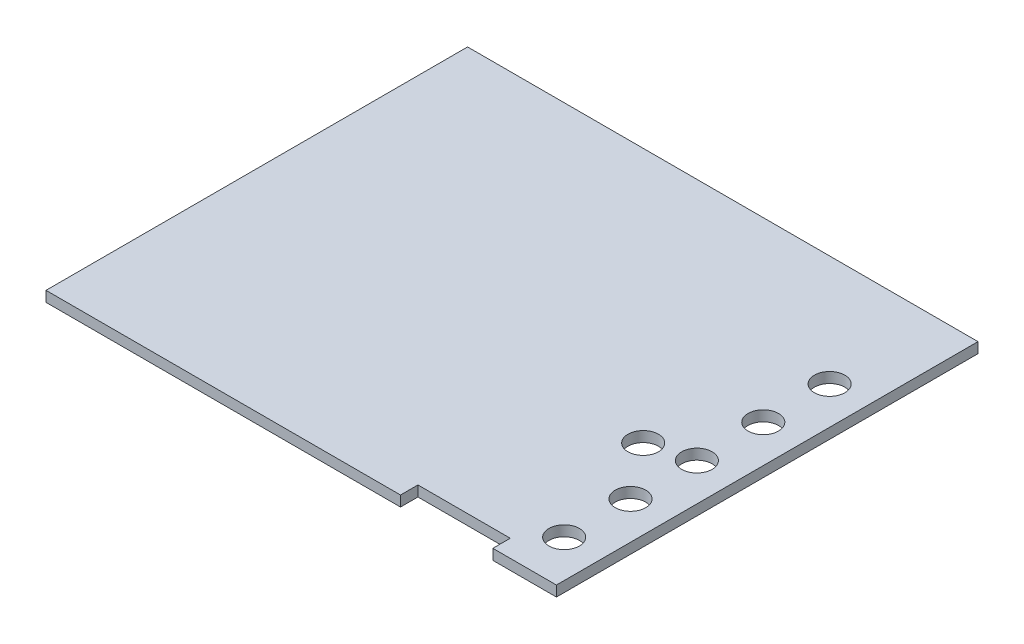
ISO-10303-21;
HEADER;
FILE_DESCRIPTION(('STEP AP214'),'2;1');
FILE_NAME('part.step','',(''),(''),'','','');
FILE_SCHEMA(('AUTOMOTIVE_DESIGN { 1 0 10303 214 1 1 1 1 }'));
ENDSEC;
DATA;
#1=APPLICATION_CONTEXT('core data for automotive mechanical design processes');
#2=APPLICATION_PROTOCOL_DEFINITION('international standard','automotive_design',2000,#1);
#3=PRODUCT_CONTEXT('',#1,'mechanical');
#4=PRODUCT('Part','Part','',(#3));
#5=PRODUCT_RELATED_PRODUCT_CATEGORY('part','',(#4));
#6=PRODUCT_DEFINITION_FORMATION('','',#4);
#7=PRODUCT_DEFINITION_CONTEXT('part definition',#1,'design');
#8=PRODUCT_DEFINITION('design','',#6,#7);
#9=PRODUCT_DEFINITION_SHAPE('','',#8);
#10=(LENGTH_UNIT() NAMED_UNIT(*) SI_UNIT(.MILLI.,.METRE.));
#11=(NAMED_UNIT(*) PLANE_ANGLE_UNIT() SI_UNIT($,.RADIAN.));
#12=(NAMED_UNIT(*) SI_UNIT($,.STERADIAN.) SOLID_ANGLE_UNIT());
#13=UNCERTAINTY_MEASURE_WITH_UNIT(LENGTH_MEASURE(1.E-05),#10,'distance_accuracy_value','');
#14=(GEOMETRIC_REPRESENTATION_CONTEXT(3) GLOBAL_UNCERTAINTY_ASSIGNED_CONTEXT((#13)) GLOBAL_UNIT_ASSIGNED_CONTEXT((#10,
#11,#12)) REPRESENTATION_CONTEXT('',''));
#15=CARTESIAN_POINT('',(0.,0.,0.));
#16=DIRECTION('',(0.,0.,1.));
#17=DIRECTION('',(1.,0.,0.));
#18=AXIS2_PLACEMENT_3D('',#15,#16,#17);
#19=CARTESIAN_POINT('',(-25.1243123671328,-11.317405418431,38.0928104439577));
#20=DIRECTION('',(0.,1.,0.));
#21=DIRECTION('',(0.,0.,1.));
#22=AXIS2_PLACEMENT_3D('',#19,#20,#21);
#23=PLANE('',#22);
#24=CARTESIAN_POINT('',(24.3357861328672,-11.317405418431,18.9887724439577));
#25=DIRECTION('',(0.,-1.,0.));
#26=DIRECTION('',(1.,0.,0.));
#27=AXIS2_PLACEMENT_3D('',#24,#25,#26);
#28=CIRCLE('',#27,1.75);
#29=CARTESIAN_POINT('',(26.0857861328672,-11.317405418431,18.9887724439577));
#30=VERTEX_POINT('',#29);
#31=EDGE_CURVE('E118',#30,#30,#28,.T.);
#32=ORIENTED_EDGE('',*,*,#31,.T.);
#33=EDGE_LOOP('',(#32));
#34=FACE_BOUND('',#33,.T.);
#35=CARTESIAN_POINT('',(29.1672961328672,-11.317405418431,32.8962004439577));
#36=DIRECTION('',(0.,-1.,0.));
#37=DIRECTION('',(1.,0.,0.));
#38=AXIS2_PLACEMENT_3D('',#35,#36,#37);
#39=CIRCLE('',#38,1.75);
#40=CARTESIAN_POINT('',(30.9172961328672,-11.317405418431,32.8962004439577));
#41=VERTEX_POINT('',#40);
#42=EDGE_CURVE('E121',#41,#41,#39,.T.);
#43=ORIENTED_EDGE('',*,*,#42,.T.);
#44=EDGE_LOOP('',(#43));
#45=FACE_BOUND('',#44,.T.);
#46=CARTESIAN_POINT('',(29.1672961328672,-11.317405418431,25.2761844439577));
#47=DIRECTION('',(0.,-1.,0.));
#48=DIRECTION('',(1.,0.,0.));
#49=AXIS2_PLACEMENT_3D('',#46,#47,#48);
#50=CIRCLE('',#49,1.75);
#51=CARTESIAN_POINT('',(30.9172961328672,-11.317405418431,25.2761844439577));
#52=VERTEX_POINT('',#51);
#53=EDGE_CURVE('E124',#52,#52,#50,.T.);
#54=ORIENTED_EDGE('',*,*,#53,.T.);
#55=EDGE_LOOP('',(#54));
#56=FACE_BOUND('',#55,.T.);
#57=CARTESIAN_POINT('',(29.1672966328672,-11.317405418431,17.6561694439577));
#58=DIRECTION('',(0.,-1.,0.));
#59=DIRECTION('',(1.,0.,0.));
#60=AXIS2_PLACEMENT_3D('',#57,#58,#59);
#61=CIRCLE('',#60,1.75);
#62=CARTESIAN_POINT('',(30.9172966328672,-11.317405418431,17.6561694439577));
#63=VERTEX_POINT('',#62);
#64=EDGE_CURVE('E127',#63,#63,#61,.T.);
#65=ORIENTED_EDGE('',*,*,#64,.T.);
#66=EDGE_LOOP('',(#65));
#67=FACE_BOUND('',#66,.T.);
#68=CARTESIAN_POINT('',(29.1672961328672,-11.317405418431,10.0361544439577));
#69=DIRECTION('',(0.,-1.,0.));
#70=DIRECTION('',(1.,0.,0.));
#71=AXIS2_PLACEMENT_3D('',#68,#69,#70);
#72=CIRCLE('',#71,1.75);
#73=CARTESIAN_POINT('',(30.9172961328672,-11.317405418431,10.0361544439577));
#74=VERTEX_POINT('',#73);
#75=EDGE_CURVE('E129',#74,#74,#72,.T.);
#76=ORIENTED_EDGE('',*,*,#75,.T.);
#77=EDGE_LOOP('',(#76));
#78=FACE_BOUND('',#77,.T.);
#79=CARTESIAN_POINT('',(29.1672966328672,-11.317405418431,2.41613894395773));
#80=DIRECTION('',(0.,-1.,0.));
#81=DIRECTION('',(1.,0.,0.));
#82=AXIS2_PLACEMENT_3D('',#79,#80,#81);
#83=CIRCLE('',#82,1.75);
#84=CARTESIAN_POINT('',(30.9172966328672,-11.317405418431,2.41613894395773));
#85=VERTEX_POINT('',#84);
#86=EDGE_CURVE('E19',#85,#85,#83,.T.);
#87=ORIENTED_EDGE('',*,*,#86,.T.);
#88=EDGE_LOOP('',(#87));
#89=FACE_BOUND('',#88,.T.);
#90=DIRECTION('',(0.,0.,1.));
#91=VECTOR('',#90,1.);
#92=CARTESIAN_POINT('',(33.4758046328672,-11.317405418431,-10.3072865560423));
#93=LINE('',#92,#91);
#94=CARTESIAN_POINT('',(33.4758046328672,-11.317405418431,38.0928104439577));
#95=VERTEX_POINT('',#94);
#96=CARTESIAN_POINT('',(33.4758046328672,-11.317405418431,-10.3072865560423));
#97=VERTEX_POINT('',#96);
#98=EDGE_CURVE('E148',#95,#97,#93,.F.);
#99=ORIENTED_EDGE('',*,*,#98,.T.);
#100=DIRECTION('',(1.,0.,0.));
#101=VECTOR('',#100,1.);
#102=CARTESIAN_POINT('',(-25.1243123671328,-11.317405418431,-10.3072865560423));
#103=LINE('',#102,#101);
#104=CARTESIAN_POINT('',(-25.1243123671328,-11.317405418431,-10.3072865560423));
#105=VERTEX_POINT('',#104);
#106=EDGE_CURVE('E143',#97,#105,#103,.F.);
#107=ORIENTED_EDGE('',*,*,#106,.T.);
#108=DIRECTION('',(0.,0.,1.));
#109=VECTOR('',#108,1.);
#110=CARTESIAN_POINT('',(-25.1243123671328,-11.317405418431,-10.3072865560423));
#111=LINE('',#110,#109);
#112=CARTESIAN_POINT('',(-25.1243123671328,-11.317405418431,38.0928104439577));
#113=VERTEX_POINT('',#112);
#114=EDGE_CURVE('E83',#105,#113,#111,.T.);
#115=ORIENTED_EDGE('',*,*,#114,.T.);
#116=DIRECTION('',(1.,0.,0.));
#117=VECTOR('',#116,1.);
#118=CARTESIAN_POINT('',(-25.1243123671328,-11.317405418431,38.0928104439577));
#119=LINE('',#118,#117);
#120=CARTESIAN_POINT('',(15.5757686328672,-11.317405418431,38.0928104439577));
#121=VERTEX_POINT('',#120);
#122=EDGE_CURVE('E82',#113,#121,#119,.T.);
#123=ORIENTED_EDGE('',*,*,#122,.T.);
#124=DIRECTION('',(0.,0.,1.));
#125=VECTOR('',#124,1.);
#126=CARTESIAN_POINT('',(15.5757686328672,-11.317405418431,38.0928104439577));
#127=LINE('',#126,#125);
#128=CARTESIAN_POINT('',(15.5757686328672,-11.317405418431,36.0928064439577));
#129=VERTEX_POINT('',#128);
#130=EDGE_CURVE('E79',#121,#129,#127,.F.);
#131=ORIENTED_EDGE('',*,*,#130,.T.);
#132=DIRECTION('',(1.,0.,0.));
#133=VECTOR('',#132,1.);
#134=CARTESIAN_POINT('',(15.5757686328672,-11.317405418431,36.0928064439577));
#135=LINE('',#134,#133);
#136=CARTESIAN_POINT('',(26.1757906328672,-11.317405418431,36.0928064439577));
#137=VERTEX_POINT('',#136);
#138=EDGE_CURVE('E163',#129,#137,#135,.T.);
#139=ORIENTED_EDGE('',*,*,#138,.T.);
#140=DIRECTION('',(0.,0.,1.));
#141=VECTOR('',#140,1.);
#142=CARTESIAN_POINT('',(26.1757906328672,-11.317405418431,36.0928064439577));
#143=LINE('',#142,#141);
#144=CARTESIAN_POINT('',(26.1757906328672,-11.317405418431,38.0928104439577));
#145=VERTEX_POINT('',#144);
#146=EDGE_CURVE('E158',#137,#145,#143,.T.);
#147=ORIENTED_EDGE('',*,*,#146,.T.);
#148=DIRECTION('',(1.,0.,0.));
#149=VECTOR('',#148,1.);
#150=CARTESIAN_POINT('',(26.1757906328672,-11.317405418431,38.0928104439577));
#151=LINE('',#150,#149);
#152=EDGE_CURVE('E153',#145,#95,#151,.T.);
#153=ORIENTED_EDGE('',*,*,#152,.T.);
#154=EDGE_LOOP('',(#99,#107,#115,#123,#131,#139,#147,#153));
#155=FACE_BOUND('',#154,.T.);
#156=ADVANCED_FACE('F16',(#34,#45,#56,#67,#78,#89,#155),#23,.T.);
#157=CARTESIAN_POINT('',(-25.1243123671328,-11.317405418431,38.0928104439577));
#158=DIRECTION('',(0.,0.,-1.));
#159=DIRECTION('',(0.,1.,0.));
#160=AXIS2_PLACEMENT_3D('',#157,#158,#159);
#161=PLANE('',#160);
#162=DIRECTION('',(0.,-1.,0.));
#163=VECTOR('',#162,1.);
#164=CARTESIAN_POINT('',(15.5757686328672,-11.317405418431,38.0928104439577));
#165=LINE('',#164,#163);
#166=CARTESIAN_POINT('',(15.5757686328672,-12.517405418431,38.0928104439577));
#167=VERTEX_POINT('',#166);
#168=EDGE_CURVE('E88',#167,#121,#165,.F.);
#169=ORIENTED_EDGE('',*,*,#168,.T.);
#170=ORIENTED_EDGE('',*,*,#122,.F.);
#171=DIRECTION('',(0.,1.,0.));
#172=VECTOR('',#171,1.);
#173=CARTESIAN_POINT('',(-25.1243123671328,-11.317405418431,38.0928104439577));
#174=LINE('',#173,#172);
#175=CARTESIAN_POINT('',(-25.1243123671328,-12.517405418431,38.0928104439577));
#176=VERTEX_POINT('',#175);
#177=EDGE_CURVE('E134',#113,#176,#174,.F.);
#178=ORIENTED_EDGE('',*,*,#177,.T.);
#179=DIRECTION('',(1.,0.,0.));
#180=VECTOR('',#179,1.);
#181=CARTESIAN_POINT('',(-25.1243123671328,-12.517405418431,38.0928104439577));
#182=LINE('',#181,#180);
#183=EDGE_CURVE('E99',#176,#167,#182,.T.);
#184=ORIENTED_EDGE('',*,*,#183,.T.);
#185=EDGE_LOOP('',(#169,#170,#178,#184));
#186=FACE_BOUND('',#185,.T.);
#187=ADVANCED_FACE('F98',(#186),#161,.F.);
#188=CARTESIAN_POINT('',(15.5757686328672,-11.317405418431,38.0928104439577));
#189=DIRECTION('',(-1.,0.,0.));
#190=DIRECTION('',(0.,-1.,0.));
#191=AXIS2_PLACEMENT_3D('',#188,#189,#190);
#192=PLANE('',#191);
#193=DIRECTION('',(0.,1.,0.));
#194=VECTOR('',#193,1.);
#195=CARTESIAN_POINT('',(15.5757686328672,-11.317405418431,36.0928064439577));
#196=LINE('',#195,#194);
#197=CARTESIAN_POINT('',(15.5757686328672,-12.517405418431,36.0928064439577));
#198=VERTEX_POINT('',#197);
#199=EDGE_CURVE('E95',#198,#129,#196,.T.);
#200=ORIENTED_EDGE('',*,*,#199,.T.);
#201=ORIENTED_EDGE('',*,*,#130,.F.);
#202=ORIENTED_EDGE('',*,*,#168,.F.);
#203=DIRECTION('',(0.,0.,1.));
#204=VECTOR('',#203,1.);
#205=CARTESIAN_POINT('',(15.5757686328672,-12.517405418431,38.0928104439577));
#206=LINE('',#205,#204);
#207=EDGE_CURVE('E177',#167,#198,#206,.F.);
#208=ORIENTED_EDGE('',*,*,#207,.T.);
#209=EDGE_LOOP('',(#200,#201,#202,#208));
#210=FACE_BOUND('',#209,.T.);
#211=ADVANCED_FACE('F92',(#210),#192,.F.);
#212=CARTESIAN_POINT('',(15.5757686328672,-11.317405418431,36.0928064439577));
#213=DIRECTION('',(0.,0.,-1.));
#214=DIRECTION('',(0.,1.,0.));
#215=AXIS2_PLACEMENT_3D('',#212,#213,#214);
#216=PLANE('',#215);
#217=DIRECTION('',(0.,1.,0.));
#218=VECTOR('',#217,1.);
#219=CARTESIAN_POINT('',(26.1757906328672,-11.317405418431,36.0928064439577));
#220=LINE('',#219,#218);
#221=CARTESIAN_POINT('',(26.1757906328672,-12.517405418431,36.0928064439577));
#222=VERTEX_POINT('',#221);
#223=EDGE_CURVE('E160',#222,#137,#220,.T.);
#224=ORIENTED_EDGE('',*,*,#223,.T.);
#225=ORIENTED_EDGE('',*,*,#138,.F.);
#226=ORIENTED_EDGE('',*,*,#199,.F.);
#227=DIRECTION('',(1.,0.,0.));
#228=VECTOR('',#227,1.);
#229=CARTESIAN_POINT('',(-25.1243123671328,-12.517405418431,36.0928064439577));
#230=LINE('',#229,#228);
#231=EDGE_CURVE('E174',#198,#222,#230,.T.);
#232=ORIENTED_EDGE('',*,*,#231,.T.);
#233=EDGE_LOOP('',(#224,#225,#226,#232));
#234=FACE_BOUND('',#233,.T.);
#235=ADVANCED_FACE('F172',(#234),#216,.F.);
#236=CARTESIAN_POINT('',(26.1757906328672,-11.317405418431,36.0928064439577));
#237=DIRECTION('',(1.,0.,0.));
#238=DIRECTION('',(0.,1.,0.));
#239=AXIS2_PLACEMENT_3D('',#236,#237,#238);
#240=PLANE('',#239);
#241=DIRECTION('',(0.,1.,0.));
#242=VECTOR('',#241,1.);
#243=CARTESIAN_POINT('',(26.1757906328672,-11.317405418431,38.0928104439577));
#244=LINE('',#243,#242);
#245=CARTESIAN_POINT('',(26.1757906328672,-12.517405418431,38.0928104439577));
#246=VERTEX_POINT('',#245);
#247=EDGE_CURVE('E155',#246,#145,#244,.T.);
#248=ORIENTED_EDGE('',*,*,#247,.T.);
#249=ORIENTED_EDGE('',*,*,#146,.F.);
#250=ORIENTED_EDGE('',*,*,#223,.F.);
#251=DIRECTION('',(0.,0.,1.));
#252=VECTOR('',#251,1.);
#253=CARTESIAN_POINT('',(26.1757906328672,-12.517405418431,38.0928104439577));
#254=LINE('',#253,#252);
#255=EDGE_CURVE('E176',#222,#246,#254,.T.);
#256=ORIENTED_EDGE('',*,*,#255,.T.);
#257=EDGE_LOOP('',(#248,#249,#250,#256));
#258=FACE_BOUND('',#257,.T.);
#259=ADVANCED_FACE('F168',(#258),#240,.F.);
#260=CARTESIAN_POINT('',(26.1757906328672,-11.317405418431,38.0928104439577));
#261=DIRECTION('',(0.,0.,-1.));
#262=DIRECTION('',(0.,1.,0.));
#263=AXIS2_PLACEMENT_3D('',#260,#261,#262);
#264=PLANE('',#263);
#265=DIRECTION('',(0.,-1.,0.));
#266=VECTOR('',#265,1.);
#267=CARTESIAN_POINT('',(33.4758046328672,-11.317405418431,38.0928104439577));
#268=LINE('',#267,#266);
#269=CARTESIAN_POINT('',(33.4758046328672,-12.517405418431,38.0928104439577));
#270=VERTEX_POINT('',#269);
#271=EDGE_CURVE('E150',#270,#95,#268,.F.);
#272=ORIENTED_EDGE('',*,*,#271,.T.);
#273=ORIENTED_EDGE('',*,*,#152,.F.);
#274=ORIENTED_EDGE('',*,*,#247,.F.);
#275=DIRECTION('',(1.,0.,0.));
#276=VECTOR('',#275,1.);
#277=CARTESIAN_POINT('',(-25.1243123671328,-12.517405418431,38.0928104439577));
#278=LINE('',#277,#276);
#279=EDGE_CURVE('E179',#246,#270,#278,.T.);
#280=ORIENTED_EDGE('',*,*,#279,.T.);
#281=EDGE_LOOP('',(#272,#273,#274,#280));
#282=FACE_BOUND('',#281,.T.);
#283=ADVANCED_FACE('F202',(#282),#264,.F.);
#284=CARTESIAN_POINT('',(33.4758046328672,-11.317405418431,-10.3072865560423));
#285=DIRECTION('',(-1.,0.,0.));
#286=DIRECTION('',(0.,-1.,0.));
#287=AXIS2_PLACEMENT_3D('',#284,#285,#286);
#288=PLANE('',#287);
#289=DIRECTION('',(0.,-1.,0.));
#290=VECTOR('',#289,1.);
#291=CARTESIAN_POINT('',(33.4758046328672,-11.317405418431,-10.3072865560423));
#292=LINE('',#291,#290);
#293=CARTESIAN_POINT('',(33.4758046328672,-12.517405418431,-10.3072865560423));
#294=VERTEX_POINT('',#293);
#295=EDGE_CURVE('E145',#294,#97,#292,.F.);
#296=ORIENTED_EDGE('',*,*,#295,.T.);
#297=ORIENTED_EDGE('',*,*,#98,.F.);
#298=ORIENTED_EDGE('',*,*,#271,.F.);
#299=DIRECTION('',(0.,0.,1.));
#300=VECTOR('',#299,1.);
#301=CARTESIAN_POINT('',(33.4758046328672,-12.517405418431,38.0928104439577));
#302=LINE('',#301,#300);
#303=EDGE_CURVE('E184',#270,#294,#302,.F.);
#304=ORIENTED_EDGE('',*,*,#303,.T.);
#305=EDGE_LOOP('',(#296,#297,#298,#304));
#306=FACE_BOUND('',#305,.T.);
#307=ADVANCED_FACE('F199',(#306),#288,.F.);
#308=CARTESIAN_POINT('',(-25.1243123671328,-11.317405418431,-10.3072865560423));
#309=DIRECTION('',(0.,0.,1.));
#310=DIRECTION('',(0.,-1.,0.));
#311=AXIS2_PLACEMENT_3D('',#308,#309,#310);
#312=PLANE('',#311);
#313=DIRECTION('',(0.,1.,0.));
#314=VECTOR('',#313,1.);
#315=CARTESIAN_POINT('',(-25.1243123671328,-11.317405418431,-10.3072865560423));
#316=LINE('',#315,#314);
#317=CARTESIAN_POINT('',(-25.1243123671328,-12.517405418431,-10.3072865560423));
#318=VERTEX_POINT('',#317);
#319=EDGE_CURVE('E34',#318,#105,#316,.T.);
#320=ORIENTED_EDGE('',*,*,#319,.T.);
#321=ORIENTED_EDGE('',*,*,#106,.F.);
#322=ORIENTED_EDGE('',*,*,#295,.F.);
#323=DIRECTION('',(1.,0.,0.));
#324=VECTOR('',#323,1.);
#325=CARTESIAN_POINT('',(-25.1243123671328,-12.517405418431,-10.3072865560423));
#326=LINE('',#325,#324);
#327=EDGE_CURVE('E187',#294,#318,#326,.F.);
#328=ORIENTED_EDGE('',*,*,#327,.T.);
#329=EDGE_LOOP('',(#320,#321,#322,#328));
#330=FACE_BOUND('',#329,.T.);
#331=ADVANCED_FACE('F195',(#330),#312,.F.);
#332=CARTESIAN_POINT('',(-25.1243123671328,-11.317405418431,-10.3072865560423));
#333=DIRECTION('',(1.,0.,0.));
#334=DIRECTION('',(0.,1.,0.));
#335=AXIS2_PLACEMENT_3D('',#332,#333,#334);
#336=PLANE('',#335);
#337=ORIENTED_EDGE('',*,*,#177,.F.);
#338=ORIENTED_EDGE('',*,*,#114,.F.);
#339=ORIENTED_EDGE('',*,*,#319,.F.);
#340=DIRECTION('',(0.,0.,1.));
#341=VECTOR('',#340,1.);
#342=CARTESIAN_POINT('',(-25.1243123671328,-12.517405418431,38.0928104439577));
#343=LINE('',#342,#341);
#344=EDGE_CURVE('E117',#318,#176,#343,.T.);
#345=ORIENTED_EDGE('',*,*,#344,.T.);
#346=EDGE_LOOP('',(#337,#338,#339,#345));
#347=FACE_BOUND('',#346,.T.);
#348=ADVANCED_FACE('F190',(#347),#336,.F.);
#349=CARTESIAN_POINT('',(29.1672966328672,-12.917405418431,2.41613894395773));
#350=DIRECTION('',(0.,-1.,0.));
#351=DIRECTION('',(1.,0.,0.));
#352=AXIS2_PLACEMENT_3D('',#349,#350,#351);
#353=CYLINDRICAL_SURFACE('',#352,1.75);
#354=ORIENTED_EDGE('',*,*,#86,.F.);
#355=EDGE_LOOP('',(#354));
#356=FACE_BOUND('',#355,.T.);
#357=CARTESIAN_POINT('',(29.1672966328672,-12.517405418431,2.41613894395773));
#358=DIRECTION('',(0.,-1.,0.));
#359=DIRECTION('',(1.,0.,0.));
#360=AXIS2_PLACEMENT_3D('',#357,#358,#359);
#361=CIRCLE('',#360,1.75);
#362=CARTESIAN_POINT('',(30.9172966328672,-12.517405418431,2.41613894395773));
#363=VERTEX_POINT('',#362);
#364=EDGE_CURVE('E114',#363,#363,#361,.T.);
#365=ORIENTED_EDGE('',*,*,#364,.T.);
#366=EDGE_LOOP('',(#365));
#367=FACE_BOUND('',#366,.T.);
#368=ADVANCED_FACE('F239',(#356,#367),#353,.F.);
#369=CARTESIAN_POINT('',(29.1672961328672,-12.917405418431,10.0361544439577));
#370=DIRECTION('',(0.,-1.,0.));
#371=DIRECTION('',(1.,0.,0.));
#372=AXIS2_PLACEMENT_3D('',#369,#370,#371);
#373=CYLINDRICAL_SURFACE('',#372,1.75);
#374=CARTESIAN_POINT('',(29.1672961328672,-12.517405418431,10.0361544439577));
#375=DIRECTION('',(0.,-1.,0.));
#376=DIRECTION('',(1.,0.,0.));
#377=AXIS2_PLACEMENT_3D('',#374,#375,#376);
#378=CIRCLE('',#377,1.75);
#379=CARTESIAN_POINT('',(30.9172961328672,-12.517405418431,10.0361544439577));
#380=VERTEX_POINT('',#379);
#381=EDGE_CURVE('E111',#380,#380,#378,.T.);
#382=ORIENTED_EDGE('',*,*,#381,.T.);
#383=EDGE_LOOP('',(#382));
#384=FACE_BOUND('',#383,.T.);
#385=ORIENTED_EDGE('',*,*,#75,.F.);
#386=EDGE_LOOP('',(#385));
#387=FACE_BOUND('',#386,.T.);
#388=ADVANCED_FACE('F235',(#384,#387),#373,.F.);
#389=CARTESIAN_POINT('',(29.1672966328672,-12.917405418431,17.6561694439577));
#390=DIRECTION('',(0.,-1.,0.));
#391=DIRECTION('',(1.,0.,0.));
#392=AXIS2_PLACEMENT_3D('',#389,#390,#391);
#393=CYLINDRICAL_SURFACE('',#392,1.75);
#394=CARTESIAN_POINT('',(29.1672966328672,-12.517405418431,17.6561694439577));
#395=DIRECTION('',(0.,-1.,0.));
#396=DIRECTION('',(1.,0.,0.));
#397=AXIS2_PLACEMENT_3D('',#394,#395,#396);
#398=CIRCLE('',#397,1.75);
#399=CARTESIAN_POINT('',(30.9172966328672,-12.517405418431,17.6561694439577));
#400=VERTEX_POINT('',#399);
#401=EDGE_CURVE('E108',#400,#400,#398,.T.);
#402=ORIENTED_EDGE('',*,*,#401,.T.);
#403=EDGE_LOOP('',(#402));
#404=FACE_BOUND('',#403,.T.);
#405=ORIENTED_EDGE('',*,*,#64,.F.);
#406=EDGE_LOOP('',(#405));
#407=FACE_BOUND('',#406,.T.);
#408=ADVANCED_FACE('F231',(#404,#407),#393,.F.);
#409=CARTESIAN_POINT('',(29.1672961328672,-12.917405418431,25.2761844439577));
#410=DIRECTION('',(0.,-1.,0.));
#411=DIRECTION('',(1.,0.,0.));
#412=AXIS2_PLACEMENT_3D('',#409,#410,#411);
#413=CYLINDRICAL_SURFACE('',#412,1.75);
#414=CARTESIAN_POINT('',(29.1672961328672,-12.517405418431,25.2761844439577));
#415=DIRECTION('',(0.,-1.,0.));
#416=DIRECTION('',(1.,0.,0.));
#417=AXIS2_PLACEMENT_3D('',#414,#415,#416);
#418=CIRCLE('',#417,1.75);
#419=CARTESIAN_POINT('',(30.9172961328672,-12.517405418431,25.2761844439577));
#420=VERTEX_POINT('',#419);
#421=EDGE_CURVE('E105',#420,#420,#418,.T.);
#422=ORIENTED_EDGE('',*,*,#421,.T.);
#423=EDGE_LOOP('',(#422));
#424=FACE_BOUND('',#423,.T.);
#425=ORIENTED_EDGE('',*,*,#53,.F.);
#426=EDGE_LOOP('',(#425));
#427=FACE_BOUND('',#426,.T.);
#428=ADVANCED_FACE('F227',(#424,#427),#413,.F.);
#429=CARTESIAN_POINT('',(29.1672961328672,-12.917405418431,32.8962004439577));
#430=DIRECTION('',(0.,-1.,0.));
#431=DIRECTION('',(1.,0.,0.));
#432=AXIS2_PLACEMENT_3D('',#429,#430,#431);
#433=CYLINDRICAL_SURFACE('',#432,1.75);
#434=CARTESIAN_POINT('',(29.1672961328672,-12.517405418431,32.8962004439577));
#435=DIRECTION('',(0.,-1.,0.));
#436=DIRECTION('',(1.,0.,0.));
#437=AXIS2_PLACEMENT_3D('',#434,#435,#436);
#438=CIRCLE('',#437,1.75);
#439=CARTESIAN_POINT('',(30.9172961328672,-12.517405418431,32.8962004439577));
#440=VERTEX_POINT('',#439);
#441=EDGE_CURVE('E25',#440,#440,#438,.T.);
#442=ORIENTED_EDGE('',*,*,#441,.T.);
#443=EDGE_LOOP('',(#442));
#444=FACE_BOUND('',#443,.T.);
#445=ORIENTED_EDGE('',*,*,#42,.F.);
#446=EDGE_LOOP('',(#445));
#447=FACE_BOUND('',#446,.T.);
#448=ADVANCED_FACE('F219',(#444,#447),#433,.F.);
#449=CARTESIAN_POINT('',(24.3357861328672,-12.917405418431,18.9887724439577));
#450=DIRECTION('',(0.,-1.,0.));
#451=DIRECTION('',(1.,0.,0.));
#452=AXIS2_PLACEMENT_3D('',#449,#450,#451);
#453=CYLINDRICAL_SURFACE('',#452,1.75);
#454=CARTESIAN_POINT('',(24.3357861328672,-12.517405418431,18.9887724439577));
#455=DIRECTION('',(0.,-1.,0.));
#456=DIRECTION('',(1.,0.,0.));
#457=AXIS2_PLACEMENT_3D('',#454,#455,#456);
#458=CIRCLE('',#457,1.75);
#459=CARTESIAN_POINT('',(26.0857861328672,-12.517405418431,18.9887724439577));
#460=VERTEX_POINT('',#459);
#461=EDGE_CURVE('E11',#460,#460,#458,.T.);
#462=ORIENTED_EDGE('',*,*,#461,.T.);
#463=EDGE_LOOP('',(#462));
#464=FACE_BOUND('',#463,.T.);
#465=ORIENTED_EDGE('',*,*,#31,.F.);
#466=EDGE_LOOP('',(#465));
#467=FACE_BOUND('',#466,.T.);
#468=ADVANCED_FACE('F213',(#464,#467),#453,.F.);
#469=CARTESIAN_POINT('',(-25.1243123671328,-12.517405418431,38.0928104439577));
#470=DIRECTION('',(0.,1.,0.));
#471=DIRECTION('',(0.,0.,1.));
#472=AXIS2_PLACEMENT_3D('',#469,#470,#471);
#473=PLANE('',#472);
#474=ORIENTED_EDGE('',*,*,#461,.F.);
#475=EDGE_LOOP('',(#474));
#476=FACE_BOUND('',#475,.T.);
#477=ORIENTED_EDGE('',*,*,#441,.F.);
#478=EDGE_LOOP('',(#477));
#479=FACE_BOUND('',#478,.T.);
#480=ORIENTED_EDGE('',*,*,#421,.F.);
#481=EDGE_LOOP('',(#480));
#482=FACE_BOUND('',#481,.T.);
#483=ORIENTED_EDGE('',*,*,#401,.F.);
#484=EDGE_LOOP('',(#483));
#485=FACE_BOUND('',#484,.T.);
#486=ORIENTED_EDGE('',*,*,#381,.F.);
#487=EDGE_LOOP('',(#486));
#488=FACE_BOUND('',#487,.T.);
#489=ORIENTED_EDGE('',*,*,#364,.F.);
#490=EDGE_LOOP('',(#489));
#491=FACE_BOUND('',#490,.T.);
#492=ORIENTED_EDGE('',*,*,#327,.F.);
#493=ORIENTED_EDGE('',*,*,#303,.F.);
#494=ORIENTED_EDGE('',*,*,#279,.F.);
#495=ORIENTED_EDGE('',*,*,#255,.F.);
#496=ORIENTED_EDGE('',*,*,#231,.F.);
#497=ORIENTED_EDGE('',*,*,#207,.F.);
#498=ORIENTED_EDGE('',*,*,#183,.F.);
#499=ORIENTED_EDGE('',*,*,#344,.F.);
#500=EDGE_LOOP('',(#492,#493,#494,#495,#496,#497,#498,#499));
#501=FACE_BOUND('',#500,.T.);
#502=ADVANCED_FACE('F192',(#476,#479,#482,#485,#488,#491,#501),#473,.F.);
#503=CLOSED_SHELL('',(#156,#187,#211,#235,#259,#283,#307,#331,#348,#368,#388,#408,#428,#448,
#468,#502));
#504=MANIFOLD_SOLID_BREP('B1',#503);
#505=ADVANCED_BREP_SHAPE_REPRESENTATION('',(#18,#504),#14);
#506=SHAPE_DEFINITION_REPRESENTATION(#9,#505);
ENDSEC;
END-ISO-10303-21;
